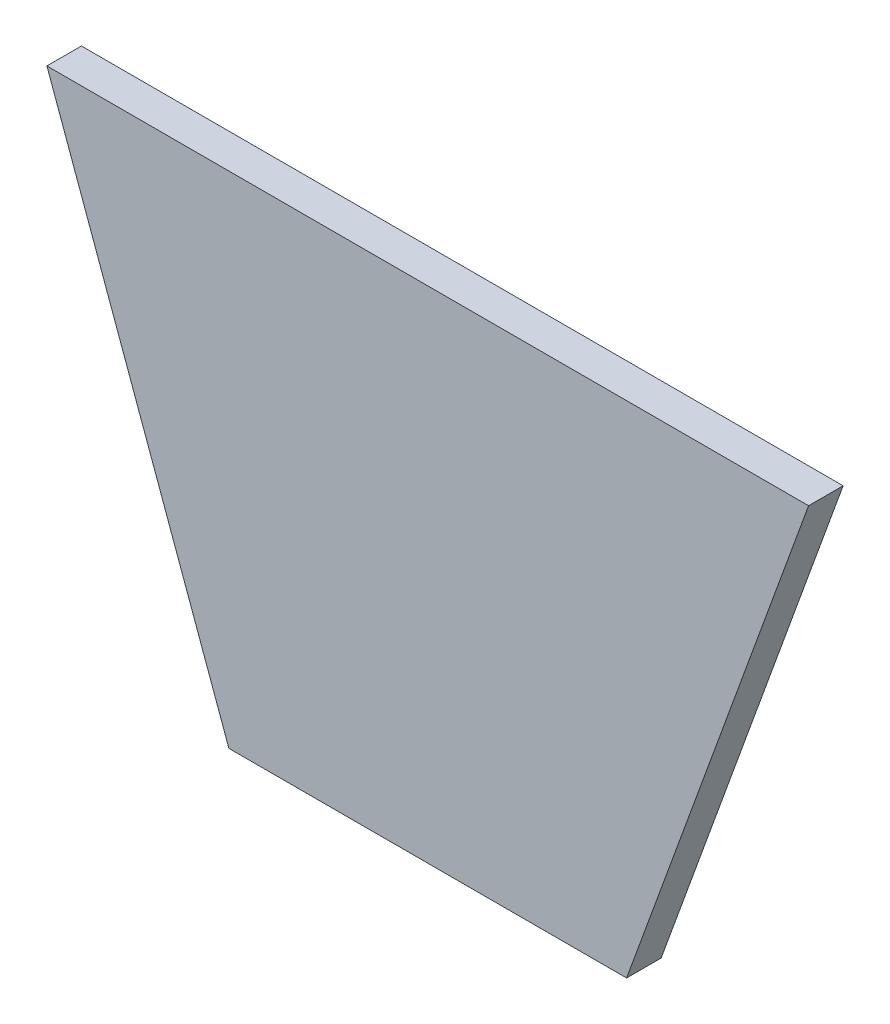
ISO-10303-21;
HEADER;
FILE_DESCRIPTION(('STEP AP214'),'2;1');
FILE_NAME('part.step','',(''),(''),'','','');
FILE_SCHEMA(('AUTOMOTIVE_DESIGN { 1 0 10303 214 1 1 1 1 }'));
ENDSEC;
DATA;
#1=APPLICATION_CONTEXT('core data for automotive mechanical design processes');
#2=APPLICATION_PROTOCOL_DEFINITION('international standard','automotive_design',2000,#1);
#3=PRODUCT_CONTEXT('',#1,'mechanical');
#4=PRODUCT('Part','Part','',(#3));
#5=PRODUCT_RELATED_PRODUCT_CATEGORY('part','',(#4));
#6=PRODUCT_DEFINITION_FORMATION('','',#4);
#7=PRODUCT_DEFINITION_CONTEXT('part definition',#1,'design');
#8=PRODUCT_DEFINITION('design','',#6,#7);
#9=PRODUCT_DEFINITION_SHAPE('','',#8);
#10=(LENGTH_UNIT() NAMED_UNIT(*) SI_UNIT(.MILLI.,.METRE.));
#11=(NAMED_UNIT(*) PLANE_ANGLE_UNIT() SI_UNIT($,.RADIAN.));
#12=(NAMED_UNIT(*) SI_UNIT($,.STERADIAN.) SOLID_ANGLE_UNIT());
#13=UNCERTAINTY_MEASURE_WITH_UNIT(LENGTH_MEASURE(1.E-05),#10,'distance_accuracy_value','');
#14=(GEOMETRIC_REPRESENTATION_CONTEXT(3) GLOBAL_UNCERTAINTY_ASSIGNED_CONTEXT((#13)) GLOBAL_UNIT_ASSIGNED_CONTEXT((#10,
#11,#12)) REPRESENTATION_CONTEXT('',''));
#15=CARTESIAN_POINT('',(0.,0.,0.));
#16=DIRECTION('',(0.,0.,1.));
#17=DIRECTION('',(1.,0.,0.));
#18=AXIS2_PLACEMENT_3D('',#15,#16,#17);
#19=CARTESIAN_POINT('',(-2.72580786629028,104.596557239522,3.));
#20=DIRECTION('',(-0.939692620785909,0.342020143325668,0.));
#21=DIRECTION('',(-0.342020143325668,-0.939692620785909,0.));
#22=AXIS2_PLACEMENT_3D('',#19,#20,#21);
#23=PLANE('',#22);
#24=DIRECTION('',(0.342020143325668,0.939692620785908,0.));
#25=VECTOR('',#24,1.);
#26=CARTESIAN_POINT('',(-2.72580786629028,104.596557239522,0.));
#27=LINE('',#26,#25);
#28=CARTESIAN_POINT('',(-2.72580786629028,104.596557239522,0.));
#29=VERTEX_POINT('',#28);
#30=CARTESIAN_POINT('',(13.0812385827568,148.026060426549,0.));
#31=VERTEX_POINT('',#30);
#32=EDGE_CURVE('E95',#29,#31,#27,.T.);
#33=ORIENTED_EDGE('',*,*,#32,.T.);
#34=DIRECTION('',(0.,0.,-1.));
#35=VECTOR('',#34,1.);
#36=CARTESIAN_POINT('',(13.0812385827568,148.026060426549,3.));
#37=LINE('',#36,#35);
#38=CARTESIAN_POINT('',(13.0812385827568,148.026060426549,3.));
#39=VERTEX_POINT('',#38);
#40=EDGE_CURVE('E11',#39,#31,#37,.T.);
#41=ORIENTED_EDGE('',*,*,#40,.F.);
#42=DIRECTION('',(0.342020143325668,0.939692620785908,0.));
#43=VECTOR('',#42,1.);
#44=CARTESIAN_POINT('',(-2.72580786629028,104.596557239522,3.));
#45=LINE('',#44,#43);
#46=CARTESIAN_POINT('',(-2.72580786629028,104.596557239522,3.));
#47=VERTEX_POINT('',#46);
#48=EDGE_CURVE('E83',#47,#39,#45,.T.);
#49=ORIENTED_EDGE('',*,*,#48,.F.);
#50=DIRECTION('',(0.,0.,-1.));
#51=VECTOR('',#50,1.);
#52=CARTESIAN_POINT('',(-2.72580786629028,104.596557239522,3.));
#53=LINE('',#52,#51);
#54=EDGE_CURVE('E91',#47,#29,#53,.T.);
#55=ORIENTED_EDGE('',*,*,#54,.T.);
#56=EDGE_LOOP('',(#33,#41,#49,#55));
#57=FACE_BOUND('',#56,.T.);
#58=ADVANCED_FACE('F32',(#57),#23,.F.);
#59=CARTESIAN_POINT('',(13.0812385827568,148.026060426549,3.));
#60=DIRECTION('',(0.,-1.,0.));
#61=DIRECTION('',(0.,0.,-1.));
#62=AXIS2_PLACEMENT_3D('',#59,#60,#61);
#63=PLANE('',#62);
#64=DIRECTION('',(-1.,0.,0.));
#65=VECTOR('',#64,1.);
#66=CARTESIAN_POINT('',(13.0812385827568,148.026060426549,0.));
#67=LINE('',#66,#65);
#68=CARTESIAN_POINT('',(-53.0812385827562,148.026060426549,0.));
#69=VERTEX_POINT('',#68);
#70=EDGE_CURVE('E87',#31,#69,#67,.T.);
#71=ORIENTED_EDGE('',*,*,#70,.T.);
#72=DIRECTION('',(0.,0.,-1.));
#73=VECTOR('',#72,1.);
#74=CARTESIAN_POINT('',(-53.0812385827562,148.026060426549,3.));
#75=LINE('',#74,#73);
#76=CARTESIAN_POINT('',(-53.0812385827562,148.026060426549,3.));
#77=VERTEX_POINT('',#76);
#78=EDGE_CURVE('E40',#77,#69,#75,.T.);
#79=ORIENTED_EDGE('',*,*,#78,.F.);
#80=DIRECTION('',(-1.,0.,0.));
#81=VECTOR('',#80,1.);
#82=CARTESIAN_POINT('',(13.0812385827568,148.026060426549,3.));
#83=LINE('',#82,#81);
#84=EDGE_CURVE('E78',#39,#77,#83,.T.);
#85=ORIENTED_EDGE('',*,*,#84,.F.);
#86=ORIENTED_EDGE('',*,*,#40,.T.);
#87=EDGE_LOOP('',(#71,#79,#85,#86));
#88=FACE_BOUND('',#87,.T.);
#89=ADVANCED_FACE('F86',(#88),#63,.F.);
#90=CARTESIAN_POINT('',(-53.0812385827562,148.026060426549,3.));
#91=DIRECTION('',(0.939692620785909,0.342020143325668,0.));
#92=DIRECTION('',(-0.342020143325668,0.939692620785909,0.));
#93=AXIS2_PLACEMENT_3D('',#90,#91,#92);
#94=PLANE('',#93);
#95=DIRECTION('',(0.342020143325668,-0.939692620785909,0.));
#96=VECTOR('',#95,1.);
#97=CARTESIAN_POINT('',(-53.0812385827562,148.026060426549,0.));
#98=LINE('',#97,#96);
#99=CARTESIAN_POINT('',(-37.2741921337092,104.596557239522,0.));
#100=VERTEX_POINT('',#99);
#101=EDGE_CURVE('E65',#69,#100,#98,.T.);
#102=ORIENTED_EDGE('',*,*,#101,.T.);
#103=DIRECTION('',(0.,0.,-1.));
#104=VECTOR('',#103,1.);
#105=CARTESIAN_POINT('',(-37.2741921337092,104.596557239522,3.));
#106=LINE('',#105,#104);
#107=CARTESIAN_POINT('',(-37.2741921337092,104.596557239522,3.));
#108=VERTEX_POINT('',#107);
#109=EDGE_CURVE('E88',#108,#100,#106,.T.);
#110=ORIENTED_EDGE('',*,*,#109,.F.);
#111=DIRECTION('',(0.342020143325668,-0.939692620785909,0.));
#112=VECTOR('',#111,1.);
#113=CARTESIAN_POINT('',(-53.0812385827562,148.026060426549,3.));
#114=LINE('',#113,#112);
#115=EDGE_CURVE('E81',#77,#108,#114,.T.);
#116=ORIENTED_EDGE('',*,*,#115,.F.);
#117=ORIENTED_EDGE('',*,*,#78,.T.);
#118=EDGE_LOOP('',(#102,#110,#116,#117));
#119=FACE_BOUND('',#118,.T.);
#120=ADVANCED_FACE('F89',(#119),#94,.F.);
#121=CARTESIAN_POINT('',(-37.2741921337092,104.596557239522,3.));
#122=DIRECTION('',(0.,1.,0.));
#123=DIRECTION('',(0.,0.,1.));
#124=AXIS2_PLACEMENT_3D('',#121,#122,#123);
#125=PLANE('',#124);
#126=DIRECTION('',(1.,0.,0.));
#127=VECTOR('',#126,1.);
#128=CARTESIAN_POINT('',(-37.2741921337092,104.596557239522,0.));
#129=LINE('',#128,#127);
#130=EDGE_CURVE('E71',#100,#29,#129,.T.);
#131=ORIENTED_EDGE('',*,*,#130,.T.);
#132=ORIENTED_EDGE('',*,*,#54,.F.);
#133=DIRECTION('',(1.,0.,0.));
#134=VECTOR('',#133,1.);
#135=CARTESIAN_POINT('',(-37.2741921337092,104.596557239522,3.));
#136=LINE('',#135,#134);
#137=EDGE_CURVE('E48',#108,#47,#136,.T.);
#138=ORIENTED_EDGE('',*,*,#137,.F.);
#139=ORIENTED_EDGE('',*,*,#109,.T.);
#140=EDGE_LOOP('',(#131,#132,#138,#139));
#141=FACE_BOUND('',#140,.T.);
#142=ADVANCED_FACE('F102',(#141),#125,.F.);
#143=CARTESIAN_POINT('',(0.,0.,3.));
#144=DIRECTION('',(0.,0.,1.));
#145=DIRECTION('',(1.,0.,0.));
#146=AXIS2_PLACEMENT_3D('',#143,#144,#145);
#147=PLANE('',#146);
#148=ORIENTED_EDGE('',*,*,#48,.T.);
#149=ORIENTED_EDGE('',*,*,#84,.T.);
#150=ORIENTED_EDGE('',*,*,#115,.T.);
#151=ORIENTED_EDGE('',*,*,#137,.T.);
#152=EDGE_LOOP('',(#148,#149,#150,#151));
#153=FACE_BOUND('',#152,.T.);
#154=ADVANCED_FACE('F79',(#153),#147,.T.);
#155=CARTESIAN_POINT('',(0.,0.,0.));
#156=DIRECTION('',(0.,0.,1.));
#157=DIRECTION('',(1.,0.,0.));
#158=AXIS2_PLACEMENT_3D('',#155,#156,#157);
#159=PLANE('',#158);
#160=ORIENTED_EDGE('',*,*,#32,.F.);
#161=ORIENTED_EDGE('',*,*,#130,.F.);
#162=ORIENTED_EDGE('',*,*,#101,.F.);
#163=ORIENTED_EDGE('',*,*,#70,.F.);
#164=EDGE_LOOP('',(#160,#161,#162,#163));
#165=FACE_BOUND('',#164,.T.);
#166=ADVANCED_FACE('F105',(#165),#159,.F.);
#167=CLOSED_SHELL('',(#58,#89,#120,#142,#154,#166));
#168=MANIFOLD_SOLID_BREP('B2',#167);
#169=ADVANCED_BREP_SHAPE_REPRESENTATION('',(#18,#168),#14);
#170=SHAPE_DEFINITION_REPRESENTATION(#9,#169);
ENDSEC;
END-ISO-10303-21;
